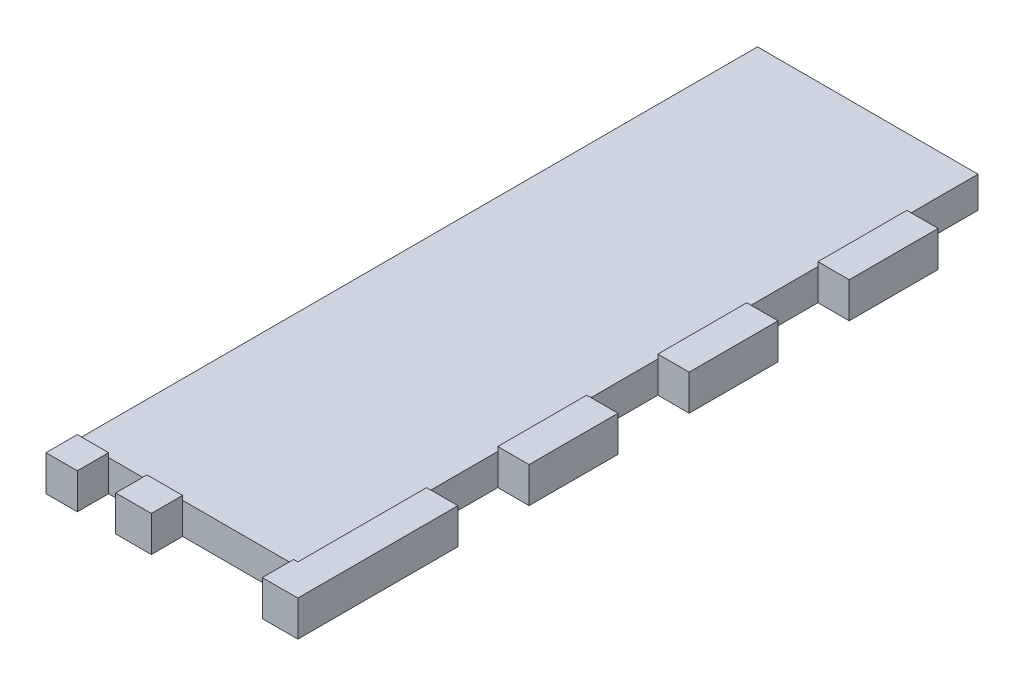
ISO-10303-21;
HEADER;
FILE_DESCRIPTION(('STEP AP214'),'2;1');
FILE_NAME('part.step','',(''),(''),'','','');
FILE_SCHEMA(('AUTOMOTIVE_DESIGN { 1 0 10303 214 1 1 1 1 }'));
ENDSEC;
DATA;
#1=APPLICATION_CONTEXT('core data for automotive mechanical design processes');
#2=APPLICATION_PROTOCOL_DEFINITION('international standard','automotive_design',2000,#1);
#3=PRODUCT_CONTEXT('',#1,'mechanical');
#4=PRODUCT('Part','Part','',(#3));
#5=PRODUCT_RELATED_PRODUCT_CATEGORY('part','',(#4));
#6=PRODUCT_DEFINITION_FORMATION('','',#4);
#7=PRODUCT_DEFINITION_CONTEXT('part definition',#1,'design');
#8=PRODUCT_DEFINITION('design','',#6,#7);
#9=PRODUCT_DEFINITION_SHAPE('','',#8);
#10=(LENGTH_UNIT() NAMED_UNIT(*) SI_UNIT(.MILLI.,.METRE.));
#11=(NAMED_UNIT(*) PLANE_ANGLE_UNIT() SI_UNIT($,.RADIAN.));
#12=(NAMED_UNIT(*) SI_UNIT($,.STERADIAN.) SOLID_ANGLE_UNIT());
#13=UNCERTAINTY_MEASURE_WITH_UNIT(LENGTH_MEASURE(1.E-05),#10,'distance_accuracy_value','');
#14=(GEOMETRIC_REPRESENTATION_CONTEXT(3) GLOBAL_UNCERTAINTY_ASSIGNED_CONTEXT((#13)) GLOBAL_UNIT_ASSIGNED_CONTEXT((#10,
#11,#12)) REPRESENTATION_CONTEXT('',''));
#15=CARTESIAN_POINT('',(0.,0.,0.));
#16=DIRECTION('',(0.,0.,1.));
#17=DIRECTION('',(1.,0.,0.));
#18=AXIS2_PLACEMENT_3D('',#15,#16,#17);
#19=CARTESIAN_POINT('',(0.,0.,0.));
#20=DIRECTION('',(0.,0.,1.));
#21=DIRECTION('',(1.,0.,0.));
#22=AXIS2_PLACEMENT_3D('',#19,#20,#21);
#23=PLANE('',#22);
#24=DIRECTION('',(1.,0.,0.));
#25=VECTOR('',#24,1.);
#26=CARTESIAN_POINT('',(-3.30200000000011,-143.002,0.));
#27=LINE('',#26,#25);
#28=CARTESIAN_POINT('',(-28.9560000000001,-143.002,0.));
#29=VERTEX_POINT('',#28);
#30=CARTESIAN_POINT('',(-23.3680000000001,-143.002,0.));
#31=VERTEX_POINT('',#30);
#32=EDGE_CURVE('E270',#29,#31,#27,.T.);
#33=ORIENTED_EDGE('',*,*,#32,.T.);
#34=DIRECTION('',(0.,-1.,0.));
#35=VECTOR('',#34,1.);
#36=CARTESIAN_POINT('',(-23.3680000000001,-143.002,0.));
#37=LINE('',#36,#35);
#38=CARTESIAN_POINT('',(-23.3680000000001,-143.764,0.));
#39=VERTEX_POINT('',#38);
#40=EDGE_CURVE('E253',#31,#39,#37,.T.);
#41=ORIENTED_EDGE('',*,*,#40,.T.);
#42=DIRECTION('',(1.,0.,0.));
#43=VECTOR('',#42,1.);
#44=CARTESIAN_POINT('',(-150.496526113721,-143.764,0.));
#45=LINE('',#44,#43);
#46=CARTESIAN_POINT('',(-28.9560000000001,-143.764,0.));
#47=VERTEX_POINT('',#46);
#48=EDGE_CURVE('E459',#47,#39,#45,.T.);
#49=ORIENTED_EDGE('',*,*,#48,.F.);
#50=DIRECTION('',(0.,-1.,0.));
#51=VECTOR('',#50,1.);
#52=CARTESIAN_POINT('',(-28.9560000000001,155.448,0.));
#53=LINE('',#52,#51);
#54=EDGE_CURVE('E277',#29,#47,#53,.T.);
#55=ORIENTED_EDGE('',*,*,#54,.F.);
#56=EDGE_LOOP('',(#33,#41,#49,#55));
#57=FACE_BOUND('',#56,.T.);
#58=ADVANCED_FACE('F36',(#57),#23,.F.);
#59=CARTESIAN_POINT('',(-16.5100000000001,-143.764,0.));
#60=VERTEX_POINT('',#59);
#61=CARTESIAN_POINT('',(-10.1600000000001,-143.764,0.));
#62=VERTEX_POINT('',#61);
#63=EDGE_CURVE('E617',#60,#62,#45,.T.);
#64=ORIENTED_EDGE('',*,*,#63,.F.);
#65=DIRECTION('',(0.,-1.,0.));
#66=VECTOR('',#65,1.);
#67=CARTESIAN_POINT('',(-16.5100000000001,-143.002,0.));
#68=LINE('',#67,#66);
#69=CARTESIAN_POINT('',(-16.5100000000001,-143.002,0.));
#70=VERTEX_POINT('',#69);
#71=EDGE_CURVE('E59',#70,#60,#68,.T.);
#72=ORIENTED_EDGE('',*,*,#71,.F.);
#73=CARTESIAN_POINT('',(-10.1600000000001,-143.002,0.));
#74=VERTEX_POINT('',#73);
#75=EDGE_CURVE('E279',#70,#74,#27,.T.);
#76=ORIENTED_EDGE('',*,*,#75,.T.);
#77=DIRECTION('',(0.,-1.,0.));
#78=VECTOR('',#77,1.);
#79=CARTESIAN_POINT('',(-10.1600000000001,-143.002,0.));
#80=LINE('',#79,#78);
#81=EDGE_CURVE('E336',#74,#62,#80,.T.);
#82=ORIENTED_EDGE('',*,*,#81,.T.);
#83=EDGE_LOOP('',(#64,#72,#76,#82));
#84=FACE_BOUND('',#83,.T.);
#85=ADVANCED_FACE('F592',(#84),#23,.F.);
#86=CARTESIAN_POINT('',(0.,0.,5.588));
#87=DIRECTION('',(0.,0.,1.));
#88=DIRECTION('',(1.,0.,0.));
#89=AXIS2_PLACEMENT_3D('',#86,#87,#88);
#90=PLANE('',#89);
#91=DIRECTION('',(0.,-1.,0.));
#92=VECTOR('',#91,1.);
#93=CARTESIAN_POINT('',(-23.3680000000001,-143.002,5.588));
#94=LINE('',#93,#92);
#95=CARTESIAN_POINT('',(-23.3680000000001,-143.002,5.588));
#96=VERTEX_POINT('',#95);
#97=CARTESIAN_POINT('',(-23.3680000000001,-149.352,5.588));
#98=VERTEX_POINT('',#97);
#99=EDGE_CURVE('E428',#96,#98,#94,.T.);
#100=ORIENTED_EDGE('',*,*,#99,.F.);
#101=DIRECTION('',(1.,0.,0.));
#102=VECTOR('',#101,1.);
#103=CARTESIAN_POINT('',(-3.30200000000011,-143.002,5.588));
#104=LINE('',#103,#102);
#105=CARTESIAN_POINT('',(-28.9560000000001,-143.002,5.58799999999996));
#106=VERTEX_POINT('',#105);
#107=EDGE_CURVE('E272',#106,#96,#104,.T.);
#108=ORIENTED_EDGE('',*,*,#107,.F.);
#109=DIRECTION('',(0.,-1.,0.));
#110=VECTOR('',#109,1.);
#111=CARTESIAN_POINT('',(-28.9560000000001,155.448,5.588));
#112=LINE('',#111,#110);
#113=CARTESIAN_POINT('',(-28.9560000000001,-149.352,5.588));
#114=VERTEX_POINT('',#113);
#115=EDGE_CURVE('E301',#106,#114,#112,.T.);
#116=ORIENTED_EDGE('',*,*,#115,.T.);
#117=DIRECTION('',(1.,0.,0.));
#118=VECTOR('',#117,1.);
#119=CARTESIAN_POINT('',(-28.9560000000001,-149.352,5.588));
#120=LINE('',#119,#118);
#121=EDGE_CURVE('E482',#114,#98,#120,.T.);
#122=ORIENTED_EDGE('',*,*,#121,.T.);
#123=EDGE_LOOP('',(#100,#108,#116,#122));
#124=FACE_BOUND('',#123,.T.);
#125=ADVANCED_FACE('F598',(#124),#90,.T.);
#126=DIRECTION('',(0.,-1.,0.));
#127=VECTOR('',#126,1.);
#128=CARTESIAN_POINT('',(-16.5100000000001,-143.002,5.588));
#129=LINE('',#128,#127);
#130=CARTESIAN_POINT('',(-16.5100000000001,-143.002,5.588));
#131=VERTEX_POINT('',#130);
#132=CARTESIAN_POINT('',(-16.5100000000001,-149.352,5.588));
#133=VERTEX_POINT('',#132);
#134=EDGE_CURVE('E316',#131,#133,#129,.T.);
#135=ORIENTED_EDGE('',*,*,#134,.T.);
#136=CARTESIAN_POINT('',(-10.1600000000001,-149.352,5.588));
#137=VERTEX_POINT('',#136);
#138=EDGE_CURVE('E319',#133,#137,#120,.T.);
#139=ORIENTED_EDGE('',*,*,#138,.T.);
#140=DIRECTION('',(0.,-1.,0.));
#141=VECTOR('',#140,1.);
#142=CARTESIAN_POINT('',(-10.1600000000001,-143.002,5.588));
#143=LINE('',#142,#141);
#144=CARTESIAN_POINT('',(-10.1600000000001,-143.002,5.588));
#145=VERTEX_POINT('',#144);
#146=EDGE_CURVE('E318',#145,#137,#143,.T.);
#147=ORIENTED_EDGE('',*,*,#146,.F.);
#148=EDGE_CURVE('E282',#131,#145,#104,.T.);
#149=ORIENTED_EDGE('',*,*,#148,.F.);
#150=EDGE_LOOP('',(#135,#139,#147,#149));
#151=FACE_BOUND('',#150,.T.);
#152=ADVANCED_FACE('F314',(#151),#90,.T.);
#153=CARTESIAN_POINT('',(-3.30200000000011,-143.002,5.588));
#154=DIRECTION('',(0.,1.,0.));
#155=DIRECTION('',(0.,0.,1.));
#156=AXIS2_PLACEMENT_3D('',#153,#154,#155);
#157=PLANE('',#156);
#158=DIRECTION('',(0.,0.,-1.));
#159=VECTOR('',#158,1.);
#160=CARTESIAN_POINT('',(-23.3680000000001,-143.002,5.588));
#161=LINE('',#160,#159);
#162=EDGE_CURVE('E257',#96,#31,#161,.T.);
#163=ORIENTED_EDGE('',*,*,#162,.T.);
#164=ORIENTED_EDGE('',*,*,#32,.F.);
#165=DIRECTION('',(0.,0.,-1.));
#166=VECTOR('',#165,1.);
#167=CARTESIAN_POINT('',(-28.9560000000001,-143.002,5.58799999999996));
#168=LINE('',#167,#166);
#169=EDGE_CURVE('E437',#106,#29,#168,.T.);
#170=ORIENTED_EDGE('',*,*,#169,.F.);
#171=ORIENTED_EDGE('',*,*,#107,.T.);
#172=EDGE_LOOP('',(#163,#164,#170,#171));
#173=FACE_BOUND('',#172,.T.);
#174=ADVANCED_FACE('F268',(#173),#157,.T.);
#175=DIRECTION('',(0.,0.,1.));
#176=VECTOR('',#175,1.);
#177=CARTESIAN_POINT('',(-16.5100000000001,-143.002,5.588));
#178=LINE('',#177,#176);
#179=EDGE_CURVE('E273',#70,#131,#178,.T.);
#180=ORIENTED_EDGE('',*,*,#179,.T.);
#181=ORIENTED_EDGE('',*,*,#148,.T.);
#182=DIRECTION('',(0.,0.,-1.));
#183=VECTOR('',#182,1.);
#184=CARTESIAN_POINT('',(-10.1600000000001,-143.002,5.588));
#185=LINE('',#184,#183);
#186=EDGE_CURVE('E310',#145,#74,#185,.T.);
#187=ORIENTED_EDGE('',*,*,#186,.T.);
#188=ORIENTED_EDGE('',*,*,#75,.F.);
#189=EDGE_LOOP('',(#180,#181,#187,#188));
#190=FACE_BOUND('',#189,.T.);
#191=ADVANCED_FACE('F308',(#190),#157,.T.);
#192=CARTESIAN_POINT('',(10.4139999999999,0.,0.));
#193=DIRECTION('',(1.,0.,0.));
#194=DIRECTION('',(0.,1.,0.));
#195=AXIS2_PLACEMENT_3D('',#192,#193,#194);
#196=PLANE('',#195);
#197=DIRECTION('',(0.,-1.,0.));
#198=VECTOR('',#197,1.);
#199=CARTESIAN_POINT('',(10.4139999999999,-143.002,-35.687));
#200=LINE('',#199,#198);
#201=CARTESIAN_POINT('',(10.4139999999999,-143.002,-35.687));
#202=VERTEX_POINT('',#201);
#203=CARTESIAN_POINT('',(10.4139999999999,-143.764,-35.687));
#204=VERTEX_POINT('',#203);
#205=EDGE_CURVE('E356',#202,#204,#200,.T.);
#206=ORIENTED_EDGE('',*,*,#205,.F.);
#207=DIRECTION('',(0.,0.,-1.));
#208=VECTOR('',#207,1.);
#209=CARTESIAN_POINT('',(10.4139999999999,-143.002,0.));
#210=LINE('',#209,#208);
#211=CARTESIAN_POINT('',(10.4139999999999,-143.002,-51.562));
#212=VERTEX_POINT('',#211);
#213=EDGE_CURVE('E447',#202,#212,#210,.T.);
#214=ORIENTED_EDGE('',*,*,#213,.T.);
#215=DIRECTION('',(0.,-1.,0.));
#216=VECTOR('',#215,1.);
#217=CARTESIAN_POINT('',(10.4139999999999,-143.002,-51.562));
#218=LINE('',#217,#216);
#219=CARTESIAN_POINT('',(10.4139999999999,-143.764,-51.562));
#220=VERTEX_POINT('',#219);
#221=EDGE_CURVE('E386',#212,#220,#218,.T.);
#222=ORIENTED_EDGE('',*,*,#221,.T.);
#223=DIRECTION('',(0.,0.,-1.));
#224=VECTOR('',#223,1.);
#225=CARTESIAN_POINT('',(10.4139999999999,-143.764,-121.412));
#226=LINE('',#225,#224);
#227=EDGE_CURVE('E568',#204,#220,#226,.T.);
#228=ORIENTED_EDGE('',*,*,#227,.F.);
#229=EDGE_LOOP('',(#206,#214,#222,#228));
#230=FACE_BOUND('',#229,.T.);
#231=ADVANCED_FACE('F567',(#230),#196,.F.);
#232=DIRECTION('',(0.,-1.,0.));
#233=VECTOR('',#232,1.);
#234=CARTESIAN_POINT('',(10.4139999999999,-143.002,-64.262));
#235=LINE('',#234,#233);
#236=CARTESIAN_POINT('',(10.4139999999999,-143.002,-64.262));
#237=VERTEX_POINT('',#236);
#238=CARTESIAN_POINT('',(10.4139999999999,-143.764,-64.262));
#239=VERTEX_POINT('',#238);
#240=EDGE_CURVE('E351',#237,#239,#235,.T.);
#241=ORIENTED_EDGE('',*,*,#240,.F.);
#242=CARTESIAN_POINT('',(10.4139999999999,-143.002,-80.137));
#243=VERTEX_POINT('',#242);
#244=EDGE_CURVE('E520',#237,#243,#210,.T.);
#245=ORIENTED_EDGE('',*,*,#244,.T.);
#246=DIRECTION('',(0.,-1.,0.));
#247=VECTOR('',#246,1.);
#248=CARTESIAN_POINT('',(10.4139999999999,-143.002,-80.137));
#249=LINE('',#248,#247);
#250=CARTESIAN_POINT('',(10.4139999999999,-143.764,-80.137));
#251=VERTEX_POINT('',#250);
#252=EDGE_CURVE('E412',#243,#251,#249,.T.);
#253=ORIENTED_EDGE('',*,*,#252,.T.);
#254=EDGE_CURVE('E570',#239,#251,#226,.T.);
#255=ORIENTED_EDGE('',*,*,#254,.F.);
#256=EDGE_LOOP('',(#241,#245,#253,#255));
#257=FACE_BOUND('',#256,.T.);
#258=ADVANCED_FACE('F524',(#257),#196,.F.);
#259=DIRECTION('',(0.,-1.,0.));
#260=VECTOR('',#259,1.);
#261=CARTESIAN_POINT('',(10.4139999999999,-143.002,-92.837));
#262=LINE('',#261,#260);
#263=CARTESIAN_POINT('',(10.4139999999999,-143.002,-92.837));
#264=VERTEX_POINT('',#263);
#265=CARTESIAN_POINT('',(10.4139999999999,-143.764,-92.837));
#266=VERTEX_POINT('',#265);
#267=EDGE_CURVE('E379',#264,#266,#262,.T.);
#268=ORIENTED_EDGE('',*,*,#267,.F.);
#269=CARTESIAN_POINT('',(10.4139999999999,-143.002,-108.712));
#270=VERTEX_POINT('',#269);
#271=EDGE_CURVE('E439',#264,#270,#210,.T.);
#272=ORIENTED_EDGE('',*,*,#271,.T.);
#273=DIRECTION('',(0.,-1.,0.));
#274=VECTOR('',#273,1.);
#275=CARTESIAN_POINT('',(10.4139999999999,-143.002,-108.712));
#276=LINE('',#275,#274);
#277=CARTESIAN_POINT('',(10.4139999999999,-143.764,-108.712));
#278=VERTEX_POINT('',#277);
#279=EDGE_CURVE('E432',#270,#278,#276,.T.);
#280=ORIENTED_EDGE('',*,*,#279,.T.);
#281=EDGE_CURVE('E573',#266,#278,#226,.T.);
#282=ORIENTED_EDGE('',*,*,#281,.F.);
#283=EDGE_LOOP('',(#268,#272,#280,#282));
#284=FACE_BOUND('',#283,.T.);
#285=ADVANCED_FACE('F532',(#284),#196,.F.);
#286=CARTESIAN_POINT('',(-28.9560000000001,-149.352,5.588));
#287=DIRECTION('',(0.,1.,0.));
#288=DIRECTION('',(0.,0.,1.));
#289=AXIS2_PLACEMENT_3D('',#286,#287,#288);
#290=PLANE('',#289);
#291=DIRECTION('',(1.,0.,0.));
#292=VECTOR('',#291,1.);
#293=CARTESIAN_POINT('',(-23.3680000000001,-149.352,0.));
#294=LINE('',#293,#292);
#295=CARTESIAN_POINT('',(-23.3680000000001,-149.352,0.));
#296=VERTEX_POINT('',#295);
#297=CARTESIAN_POINT('',(-16.5100000000001,-149.352,0.));
#298=VERTEX_POINT('',#297);
#299=EDGE_CURVE('E326',#296,#298,#294,.T.);
#300=ORIENTED_EDGE('',*,*,#299,.F.);
#301=DIRECTION('',(0.,0.,-1.));
#302=VECTOR('',#301,1.);
#303=CARTESIAN_POINT('',(-23.3680000000001,-149.352,5.588));
#304=LINE('',#303,#302);
#305=EDGE_CURVE('E323',#98,#296,#304,.T.);
#306=ORIENTED_EDGE('',*,*,#305,.F.);
#307=ORIENTED_EDGE('',*,*,#121,.F.);
#308=DIRECTION('',(0.,0.,-1.));
#309=VECTOR('',#308,1.);
#310=CARTESIAN_POINT('',(-28.9560000000001,-149.352,5.588));
#311=LINE('',#310,#309);
#312=CARTESIAN_POINT('',(-28.9560000000001,-149.352,-121.412));
#313=VERTEX_POINT('',#312);
#314=EDGE_CURVE('E12',#114,#313,#311,.T.);
#315=ORIENTED_EDGE('',*,*,#314,.T.);
#316=DIRECTION('',(1.,0.,0.));
#317=VECTOR('',#316,1.);
#318=CARTESIAN_POINT('',(10.4139999999999,-149.352,-121.412));
#319=LINE('',#318,#317);
#320=CARTESIAN_POINT('',(10.4139999999999,-149.352,-121.412));
#321=VERTEX_POINT('',#320);
#322=EDGE_CURVE('E292',#313,#321,#319,.T.);
#323=ORIENTED_EDGE('',*,*,#322,.T.);
#324=DIRECTION('',(0.,0.,-1.));
#325=VECTOR('',#324,1.);
#326=CARTESIAN_POINT('',(10.4139999999999,-149.352,0.));
#327=LINE('',#326,#325);
#328=CARTESIAN_POINT('',(10.4139999999999,-149.352,-108.712));
#329=VERTEX_POINT('',#328);
#330=EDGE_CURVE('E424',#329,#321,#327,.T.);
#331=ORIENTED_EDGE('',*,*,#330,.F.);
#332=DIRECTION('',(-1.,0.,0.));
#333=VECTOR('',#332,1.);
#334=CARTESIAN_POINT('',(0.,-149.352,-108.712));
#335=LINE('',#334,#333);
#336=CARTESIAN_POINT('',(16.0019999999999,-149.352,-108.712));
#337=VERTEX_POINT('',#336);
#338=EDGE_CURVE('E425',#337,#329,#335,.T.);
#339=ORIENTED_EDGE('',*,*,#338,.F.);
#340=DIRECTION('',(0.,0.,-1.));
#341=VECTOR('',#340,1.);
#342=CARTESIAN_POINT('',(16.0019999999999,-149.352,5.588));
#343=LINE('',#342,#341);
#344=CARTESIAN_POINT('',(16.0019999999999,-149.352,-92.837));
#345=VERTEX_POINT('',#344);
#346=EDGE_CURVE('E489',#345,#337,#343,.T.);
#347=ORIENTED_EDGE('',*,*,#346,.F.);
#348=DIRECTION('',(-1.,0.,0.));
#349=VECTOR('',#348,1.);
#350=CARTESIAN_POINT('',(-2.30560520170738E-13,-149.352,-92.837));
#351=LINE('',#350,#349);
#352=CARTESIAN_POINT('',(10.4139999999999,-149.352,-92.837));
#353=VERTEX_POINT('',#352);
#354=EDGE_CURVE('E401',#345,#353,#351,.T.);
#355=ORIENTED_EDGE('',*,*,#354,.T.);
#356=DIRECTION('',(0.,0.,-1.));
#357=VECTOR('',#356,1.);
#358=CARTESIAN_POINT('',(10.4139999999999,-149.352,0.));
#359=LINE('',#358,#357);
#360=CARTESIAN_POINT('',(10.4139999999999,-149.352,-80.137));
#361=VERTEX_POINT('',#360);
#362=EDGE_CURVE('E397',#361,#353,#359,.T.);
#363=ORIENTED_EDGE('',*,*,#362,.F.);
#364=DIRECTION('',(-1.,0.,0.));
#365=VECTOR('',#364,1.);
#366=CARTESIAN_POINT('',(0.,-149.352,-80.137));
#367=LINE('',#366,#365);
#368=CARTESIAN_POINT('',(16.0019999999999,-149.352,-80.137));
#369=VERTEX_POINT('',#368);
#370=EDGE_CURVE('E404',#369,#361,#367,.T.);
#371=ORIENTED_EDGE('',*,*,#370,.F.);
#372=CARTESIAN_POINT('',(16.0019999999999,-149.352,-64.262));
#373=VERTEX_POINT('',#372);
#374=EDGE_CURVE('E497',#373,#369,#343,.T.);
#375=ORIENTED_EDGE('',*,*,#374,.F.);
#376=DIRECTION('',(-1.,0.,0.));
#377=VECTOR('',#376,1.);
#378=CARTESIAN_POINT('',(-1.59594559789868E-13,-149.352,-64.262));
#379=LINE('',#378,#377);
#380=CARTESIAN_POINT('',(10.4139999999999,-149.352,-64.262));
#381=VERTEX_POINT('',#380);
#382=EDGE_CURVE('E375',#373,#381,#379,.T.);
#383=ORIENTED_EDGE('',*,*,#382,.T.);
#384=DIRECTION('',(0.,0.,-1.));
#385=VECTOR('',#384,1.);
#386=CARTESIAN_POINT('',(10.4139999999999,-149.352,0.));
#387=LINE('',#386,#385);
#388=CARTESIAN_POINT('',(10.4139999999999,-149.352,-51.562));
#389=VERTEX_POINT('',#388);
#390=EDGE_CURVE('E371',#389,#381,#387,.T.);
#391=ORIENTED_EDGE('',*,*,#390,.F.);
#392=DIRECTION('',(-1.,0.,0.));
#393=VECTOR('',#392,1.);
#394=CARTESIAN_POINT('',(0.,-149.352,-51.562));
#395=LINE('',#394,#393);
#396=CARTESIAN_POINT('',(16.0019999999999,-149.352,-51.562));
#397=VERTEX_POINT('',#396);
#398=EDGE_CURVE('E378',#397,#389,#395,.T.);
#399=ORIENTED_EDGE('',*,*,#398,.F.);
#400=CARTESIAN_POINT('',(16.0019999999999,-149.352,-35.687));
#401=VERTEX_POINT('',#400);
#402=EDGE_CURVE('E491',#401,#397,#343,.T.);
#403=ORIENTED_EDGE('',*,*,#402,.F.);
#404=DIRECTION('',(-1.,0.,0.));
#405=VECTOR('',#404,1.);
#406=CARTESIAN_POINT('',(0.,-149.352,-35.687));
#407=LINE('',#406,#405);
#408=CARTESIAN_POINT('',(10.4139999999999,-149.352,-35.687));
#409=VERTEX_POINT('',#408);
#410=EDGE_CURVE('E347',#401,#409,#407,.T.);
#411=ORIENTED_EDGE('',*,*,#410,.T.);
#412=DIRECTION('',(0.,0.,-1.));
#413=VECTOR('',#412,1.);
#414=CARTESIAN_POINT('',(10.4139999999999,-149.352,0.));
#415=LINE('',#414,#413);
#416=CARTESIAN_POINT('',(10.4139999999999,-149.352,-22.987));
#417=VERTEX_POINT('',#416);
#418=EDGE_CURVE('E343',#417,#409,#415,.T.);
#419=ORIENTED_EDGE('',*,*,#418,.F.);
#420=DIRECTION('',(-1.,0.,0.));
#421=VECTOR('',#420,1.);
#422=CARTESIAN_POINT('',(0.,-149.352,-22.987));
#423=LINE('',#422,#421);
#424=CARTESIAN_POINT('',(16.0019999999999,-149.352,-22.987));
#425=VERTEX_POINT('',#424);
#426=EDGE_CURVE('E350',#425,#417,#423,.T.);
#427=ORIENTED_EDGE('',*,*,#426,.F.);
#428=CARTESIAN_POINT('',(16.0019999999999,-149.352,5.588));
#429=VERTEX_POINT('',#428);
#430=EDGE_CURVE('E44',#429,#425,#343,.T.);
#431=ORIENTED_EDGE('',*,*,#430,.F.);
#432=CARTESIAN_POINT('',(9.65199999999993,-149.352,5.588));
#433=VERTEX_POINT('',#432);
#434=EDGE_CURVE('E484',#433,#429,#120,.T.);
#435=ORIENTED_EDGE('',*,*,#434,.F.);
#436=DIRECTION('',(0.,0.,1.));
#437=VECTOR('',#436,1.);
#438=CARTESIAN_POINT('',(9.65199999999993,-149.352,5.588));
#439=LINE('',#438,#437);
#440=CARTESIAN_POINT('',(9.65199999999993,-149.352,0.));
#441=VERTEX_POINT('',#440);
#442=EDGE_CURVE('E331',#441,#433,#439,.T.);
#443=ORIENTED_EDGE('',*,*,#442,.F.);
#444=DIRECTION('',(1.,0.,0.));
#445=VECTOR('',#444,1.);
#446=CARTESIAN_POINT('',(-10.1600000000001,-149.352,0.));
#447=LINE('',#446,#445);
#448=CARTESIAN_POINT('',(-10.1600000000001,-149.352,0.));
#449=VERTEX_POINT('',#448);
#450=EDGE_CURVE('E636',#449,#441,#447,.T.);
#451=ORIENTED_EDGE('',*,*,#450,.F.);
#452=DIRECTION('',(0.,0.,-1.));
#453=VECTOR('',#452,1.);
#454=CARTESIAN_POINT('',(-10.1600000000001,-149.352,5.588));
#455=LINE('',#454,#453);
#456=EDGE_CURVE('E626',#137,#449,#455,.T.);
#457=ORIENTED_EDGE('',*,*,#456,.F.);
#458=ORIENTED_EDGE('',*,*,#138,.F.);
#459=DIRECTION('',(0.,0.,1.));
#460=VECTOR('',#459,1.);
#461=CARTESIAN_POINT('',(-16.5100000000001,-149.352,5.588));
#462=LINE('',#461,#460);
#463=EDGE_CURVE('E274',#298,#133,#462,.T.);
#464=ORIENTED_EDGE('',*,*,#463,.F.);
#465=EDGE_LOOP('',(#300,#306,#307,#315,#323,#331,#339,#347,#355,#363,#371,#375,#383,#391,#399,
#403,#411,#419,#427,#431,#435,#443,#451,#457,#458,#464));
#466=FACE_BOUND('',#465,.T.);
#467=ADVANCED_FACE('F477',(#466),#290,.F.);
#468=CARTESIAN_POINT('',(16.0019999999999,155.448,5.588));
#469=DIRECTION('',(-1.,0.,0.));
#470=DIRECTION('',(0.,-1.,0.));
#471=AXIS2_PLACEMENT_3D('',#468,#469,#470);
#472=PLANE('',#471);
#473=DIRECTION('',(0.,-1.,0.));
#474=VECTOR('',#473,1.);
#475=CARTESIAN_POINT('',(16.0019999999999,-143.002,-35.687));
#476=LINE('',#475,#474);
#477=CARTESIAN_POINT('',(16.0019999999999,-143.002,-35.687));
#478=VERTEX_POINT('',#477);
#479=EDGE_CURVE('E346',#478,#401,#476,.T.);
#480=ORIENTED_EDGE('',*,*,#479,.T.);
#481=ORIENTED_EDGE('',*,*,#402,.T.);
#482=DIRECTION('',(0.,-1.,0.));
#483=VECTOR('',#482,1.);
#484=CARTESIAN_POINT('',(16.0019999999999,-143.002,-51.562));
#485=LINE('',#484,#483);
#486=CARTESIAN_POINT('',(16.0019999999999,-143.002,-51.562));
#487=VERTEX_POINT('',#486);
#488=EDGE_CURVE('E390',#487,#397,#485,.T.);
#489=ORIENTED_EDGE('',*,*,#488,.F.);
#490=DIRECTION('',(0.,0.,-1.));
#491=VECTOR('',#490,1.);
#492=CARTESIAN_POINT('',(16.0019999999999,-143.002,5.58799999999996));
#493=LINE('',#492,#491);
#494=EDGE_CURVE('E443',#478,#487,#493,.T.);
#495=ORIENTED_EDGE('',*,*,#494,.F.);
#496=EDGE_LOOP('',(#480,#481,#489,#495));
#497=FACE_BOUND('',#496,.T.);
#498=ADVANCED_FACE('F552',(#497),#472,.F.);
#499=DIRECTION('',(0.,-1.,0.));
#500=VECTOR('',#499,1.);
#501=CARTESIAN_POINT('',(16.0019999999999,-143.002,-64.262));
#502=LINE('',#501,#500);
#503=CARTESIAN_POINT('',(16.0019999999999,-143.002,-64.262));
#504=VERTEX_POINT('',#503);
#505=EDGE_CURVE('E374',#504,#373,#502,.T.);
#506=ORIENTED_EDGE('',*,*,#505,.T.);
#507=ORIENTED_EDGE('',*,*,#374,.T.);
#508=DIRECTION('',(0.,-1.,0.));
#509=VECTOR('',#508,1.);
#510=CARTESIAN_POINT('',(16.0019999999999,-143.002,-80.137));
#511=LINE('',#510,#509);
#512=CARTESIAN_POINT('',(16.0019999999999,-143.002,-80.137));
#513=VERTEX_POINT('',#512);
#514=EDGE_CURVE('E416',#513,#369,#511,.T.);
#515=ORIENTED_EDGE('',*,*,#514,.F.);
#516=EDGE_CURVE('E521',#504,#513,#493,.T.);
#517=ORIENTED_EDGE('',*,*,#516,.F.);
#518=EDGE_LOOP('',(#506,#507,#515,#517));
#519=FACE_BOUND('',#518,.T.);
#520=ADVANCED_FACE('F506',(#519),#472,.F.);
#521=DIRECTION('',(0.,-1.,0.));
#522=VECTOR('',#521,1.);
#523=CARTESIAN_POINT('',(16.0019999999999,-143.002,-92.837));
#524=LINE('',#523,#522);
#525=CARTESIAN_POINT('',(16.0019999999999,-143.002,-92.837));
#526=VERTEX_POINT('',#525);
#527=EDGE_CURVE('E400',#526,#345,#524,.T.);
#528=ORIENTED_EDGE('',*,*,#527,.T.);
#529=ORIENTED_EDGE('',*,*,#346,.T.);
#530=DIRECTION('',(0.,-1.,0.));
#531=VECTOR('',#530,1.);
#532=CARTESIAN_POINT('',(16.0019999999999,-143.002,-108.712));
#533=LINE('',#532,#531);
#534=CARTESIAN_POINT('',(16.0019999999999,-143.002,-108.712));
#535=VERTEX_POINT('',#534);
#536=EDGE_CURVE('E423',#535,#337,#533,.T.);
#537=ORIENTED_EDGE('',*,*,#536,.F.);
#538=EDGE_CURVE('E358',#526,#535,#493,.T.);
#539=ORIENTED_EDGE('',*,*,#538,.F.);
#540=EDGE_LOOP('',(#528,#529,#537,#539));
#541=FACE_BOUND('',#540,.T.);
#542=ADVANCED_FACE('F543',(#541),#472,.F.);
#543=ORIENTED_EDGE('',*,*,#213,.F.);
#544=DIRECTION('',(-1.,0.,0.));
#545=VECTOR('',#544,1.);
#546=CARTESIAN_POINT('',(0.,-143.002,-35.687));
#547=LINE('',#546,#545);
#548=EDGE_CURVE('E340',#478,#202,#547,.T.);
#549=ORIENTED_EDGE('',*,*,#548,.F.);
#550=ORIENTED_EDGE('',*,*,#494,.T.);
#551=DIRECTION('',(-1.,0.,0.));
#552=VECTOR('',#551,1.);
#553=CARTESIAN_POINT('',(0.,-143.002,-51.562));
#554=LINE('',#553,#552);
#555=EDGE_CURVE('E370',#487,#212,#554,.T.);
#556=ORIENTED_EDGE('',*,*,#555,.T.);
#557=EDGE_LOOP('',(#543,#549,#550,#556));
#558=FACE_BOUND('',#557,.T.);
#559=ADVANCED_FACE('F549',(#558),#157,.T.);
#560=ORIENTED_EDGE('',*,*,#244,.F.);
#561=DIRECTION('',(-1.,0.,0.));
#562=VECTOR('',#561,1.);
#563=CARTESIAN_POINT('',(-1.59594559789868E-13,-143.002,-64.262));
#564=LINE('',#563,#562);
#565=EDGE_CURVE('E368',#504,#237,#564,.T.);
#566=ORIENTED_EDGE('',*,*,#565,.F.);
#567=ORIENTED_EDGE('',*,*,#516,.T.);
#568=DIRECTION('',(-1.,0.,0.));
#569=VECTOR('',#568,1.);
#570=CARTESIAN_POINT('',(0.,-143.002,-80.137));
#571=LINE('',#570,#569);
#572=EDGE_CURVE('E396',#513,#243,#571,.T.);
#573=ORIENTED_EDGE('',*,*,#572,.T.);
#574=EDGE_LOOP('',(#560,#566,#567,#573));
#575=FACE_BOUND('',#574,.T.);
#576=ADVANCED_FACE('F518',(#575),#157,.T.);
#577=ORIENTED_EDGE('',*,*,#271,.F.);
#578=DIRECTION('',(-1.,0.,0.));
#579=VECTOR('',#578,1.);
#580=CARTESIAN_POINT('',(-2.30560520170738E-13,-143.002,-92.837));
#581=LINE('',#580,#579);
#582=EDGE_CURVE('E394',#526,#264,#581,.T.);
#583=ORIENTED_EDGE('',*,*,#582,.F.);
#584=ORIENTED_EDGE('',*,*,#538,.T.);
#585=DIRECTION('',(-1.,0.,0.));
#586=VECTOR('',#585,1.);
#587=CARTESIAN_POINT('',(0.,-143.002,-108.712));
#588=LINE('',#587,#586);
#589=EDGE_CURVE('E420',#535,#270,#588,.T.);
#590=ORIENTED_EDGE('',*,*,#589,.T.);
#591=EDGE_LOOP('',(#577,#583,#584,#590));
#592=FACE_BOUND('',#591,.T.);
#593=ADVANCED_FACE('F537',(#592),#157,.T.);
#594=CARTESIAN_POINT('',(9.65199999999994,-143.764,0.));
#595=VERTEX_POINT('',#594);
#596=CARTESIAN_POINT('',(10.4139999999999,-143.764,0.));
#597=VERTEX_POINT('',#596);
#598=EDGE_CURVE('E458',#595,#597,#45,.T.);
#599=ORIENTED_EDGE('',*,*,#598,.F.);
#600=DIRECTION('',(0.,-1.,0.));
#601=VECTOR('',#600,1.);
#602=CARTESIAN_POINT('',(9.65199999999993,-143.002,0.));
#603=LINE('',#602,#601);
#604=CARTESIAN_POINT('',(9.65199999999993,-143.002,0.));
#605=VERTEX_POINT('',#604);
#606=EDGE_CURVE('E51',#605,#595,#603,.T.);
#607=ORIENTED_EDGE('',*,*,#606,.F.);
#608=CARTESIAN_POINT('',(10.4139999999999,-143.002,0.));
#609=VERTEX_POINT('',#608);
#610=EDGE_CURVE('E281',#605,#609,#27,.T.);
#611=ORIENTED_EDGE('',*,*,#610,.T.);
#612=DIRECTION('',(0.,1.,0.));
#613=VECTOR('',#612,1.);
#614=CARTESIAN_POINT('',(10.4139999999999,0.,0.));
#615=LINE('',#614,#613);
#616=EDGE_CURVE('E286',#597,#609,#615,.T.);
#617=ORIENTED_EDGE('',*,*,#616,.F.);
#618=EDGE_LOOP('',(#599,#607,#611,#617));
#619=FACE_BOUND('',#618,.T.);
#620=ADVANCED_FACE('F594',(#619),#23,.F.);
#621=CARTESIAN_POINT('',(10.4139999999999,-143.002,-22.987));
#622=VERTEX_POINT('',#621);
#623=EDGE_CURVE('E444',#609,#622,#210,.T.);
#624=ORIENTED_EDGE('',*,*,#623,.T.);
#625=DIRECTION('',(0.,-1.,0.));
#626=VECTOR('',#625,1.);
#627=CARTESIAN_POINT('',(10.4139999999999,-143.002,-22.987));
#628=LINE('',#627,#626);
#629=CARTESIAN_POINT('',(10.4139999999999,-143.764,-22.987));
#630=VERTEX_POINT('',#629);
#631=EDGE_CURVE('E360',#622,#630,#628,.T.);
#632=ORIENTED_EDGE('',*,*,#631,.T.);
#633=EDGE_CURVE('E451',#597,#630,#226,.T.);
#634=ORIENTED_EDGE('',*,*,#633,.F.);
#635=ORIENTED_EDGE('',*,*,#616,.T.);
#636=EDGE_LOOP('',(#624,#632,#634,#635));
#637=FACE_BOUND('',#636,.T.);
#638=ADVANCED_FACE('F603',(#637),#196,.F.);
#639=DIRECTION('',(0.,-1.,0.));
#640=VECTOR('',#639,1.);
#641=CARTESIAN_POINT('',(9.65199999999993,-143.002,5.588));
#642=LINE('',#641,#640);
#643=CARTESIAN_POINT('',(9.65199999999993,-143.002,5.588));
#644=VERTEX_POINT('',#643);
#645=EDGE_CURVE('E324',#644,#433,#642,.T.);
#646=ORIENTED_EDGE('',*,*,#645,.T.);
#647=ORIENTED_EDGE('',*,*,#434,.T.);
#648=DIRECTION('',(0.,1.,0.));
#649=VECTOR('',#648,1.);
#650=CARTESIAN_POINT('',(16.0019999999999,155.448,5.588));
#651=LINE('',#650,#649);
#652=CARTESIAN_POINT('',(16.0019999999999,-143.002,5.58799999999996));
#653=VERTEX_POINT('',#652);
#654=EDGE_CURVE('E487',#429,#653,#651,.T.);
#655=ORIENTED_EDGE('',*,*,#654,.T.);
#656=EDGE_CURVE('E278',#644,#653,#104,.T.);
#657=ORIENTED_EDGE('',*,*,#656,.F.);
#658=EDGE_LOOP('',(#646,#647,#655,#657));
#659=FACE_BOUND('',#658,.T.);
#660=ADVANCED_FACE('F608',(#659),#90,.T.);
#661=CARTESIAN_POINT('',(-28.9560000000001,155.448,5.588));
#662=DIRECTION('',(1.,0.,0.));
#663=DIRECTION('',(0.,1.,0.));
#664=AXIS2_PLACEMENT_3D('',#661,#662,#663);
#665=PLANE('',#664);
#666=ORIENTED_EDGE('',*,*,#115,.F.);
#667=ORIENTED_EDGE('',*,*,#169,.T.);
#668=ORIENTED_EDGE('',*,*,#54,.T.);
#669=DIRECTION('',(0.,0.,1.));
#670=VECTOR('',#669,1.);
#671=CARTESIAN_POINT('',(-28.9560000000001,-143.764,-121.412));
#672=LINE('',#671,#670);
#673=CARTESIAN_POINT('',(-28.9560000000001,-143.764,-121.412));
#674=VERTEX_POINT('',#673);
#675=EDGE_CURVE('E450',#674,#47,#672,.T.);
#676=ORIENTED_EDGE('',*,*,#675,.F.);
#677=DIRECTION('',(0.,1.,0.));
#678=VECTOR('',#677,1.);
#679=CARTESIAN_POINT('',(-28.9560000000001,-143.764,-121.412));
#680=LINE('',#679,#678);
#681=EDGE_CURVE('E298',#313,#674,#680,.T.);
#682=ORIENTED_EDGE('',*,*,#681,.F.);
#683=ORIENTED_EDGE('',*,*,#314,.F.);
#684=EDGE_LOOP('',(#666,#667,#668,#676,#682,#683));
#685=FACE_BOUND('',#684,.T.);
#686=ADVANCED_FACE('F38',(#685),#665,.F.);
#687=ORIENTED_EDGE('',*,*,#430,.T.);
#688=DIRECTION('',(0.,-1.,0.));
#689=VECTOR('',#688,1.);
#690=CARTESIAN_POINT('',(16.0019999999999,-143.002,-22.987));
#691=LINE('',#690,#689);
#692=CARTESIAN_POINT('',(16.0019999999999,-143.002,-22.987));
#693=VERTEX_POINT('',#692);
#694=EDGE_CURVE('E364',#693,#425,#691,.T.);
#695=ORIENTED_EDGE('',*,*,#694,.F.);
#696=EDGE_CURVE('E440',#653,#693,#493,.T.);
#697=ORIENTED_EDGE('',*,*,#696,.F.);
#698=ORIENTED_EDGE('',*,*,#654,.F.);
#699=EDGE_LOOP('',(#687,#695,#697,#698));
#700=FACE_BOUND('',#699,.T.);
#701=ADVANCED_FACE('F644',(#700),#472,.F.);
#702=DIRECTION('',(0.,0.,1.));
#703=VECTOR('',#702,1.);
#704=CARTESIAN_POINT('',(9.65199999999993,-143.002,5.588));
#705=LINE('',#704,#703);
#706=EDGE_CURVE('E629',#605,#644,#705,.T.);
#707=ORIENTED_EDGE('',*,*,#706,.T.);
#708=ORIENTED_EDGE('',*,*,#656,.T.);
#709=ORIENTED_EDGE('',*,*,#696,.T.);
#710=DIRECTION('',(-1.,0.,0.));
#711=VECTOR('',#710,1.);
#712=CARTESIAN_POINT('',(0.,-143.002,-22.987));
#713=LINE('',#712,#711);
#714=EDGE_CURVE('E342',#693,#622,#713,.T.);
#715=ORIENTED_EDGE('',*,*,#714,.T.);
#716=ORIENTED_EDGE('',*,*,#623,.F.);
#717=ORIENTED_EDGE('',*,*,#610,.F.);
#718=EDGE_LOOP('',(#707,#708,#709,#715,#716,#717));
#719=FACE_BOUND('',#718,.T.);
#720=ADVANCED_FACE('F611',(#719),#157,.T.);
#721=CARTESIAN_POINT('',(10.4139999999999,-1.34016615816207E-13,-121.412));
#722=DIRECTION('',(0.,0.,1.));
#723=DIRECTION('',(0.,-1.,0.));
#724=AXIS2_PLACEMENT_3D('',#721,#722,#723);
#725=PLANE('',#724);
#726=DIRECTION('',(1.,0.,0.));
#727=VECTOR('',#726,1.);
#728=CARTESIAN_POINT('',(-150.496526113721,-143.764,-121.412));
#729=LINE('',#728,#727);
#730=CARTESIAN_POINT('',(10.4139999999999,-143.764,-121.412));
#731=VERTEX_POINT('',#730);
#732=EDGE_CURVE('E454',#674,#731,#729,.T.);
#733=ORIENTED_EDGE('',*,*,#732,.T.);
#734=DIRECTION('',(0.,-1.,0.));
#735=VECTOR('',#734,1.);
#736=CARTESIAN_POINT('',(10.4139999999999,-143.002,-121.412));
#737=LINE('',#736,#735);
#738=EDGE_CURVE('E405',#731,#321,#737,.T.);
#739=ORIENTED_EDGE('',*,*,#738,.T.);
#740=ORIENTED_EDGE('',*,*,#322,.F.);
#741=ORIENTED_EDGE('',*,*,#681,.T.);
#742=EDGE_LOOP('',(#733,#739,#740,#741));
#743=FACE_BOUND('',#742,.T.);
#744=ADVANCED_FACE('F473',(#743),#725,.F.);
#745=CARTESIAN_POINT('',(-150.496526113721,-143.764,-121.412));
#746=DIRECTION('',(0.,-1.,0.));
#747=DIRECTION('',(1.,0.,0.));
#748=AXIS2_PLACEMENT_3D('',#745,#746,#747);
#749=PLANE('',#748);
#750=ORIENTED_EDGE('',*,*,#732,.F.);
#751=ORIENTED_EDGE('',*,*,#675,.T.);
#752=ORIENTED_EDGE('',*,*,#48,.T.);
#753=EDGE_CURVE('E460',#39,#60,#45,.T.);
#754=ORIENTED_EDGE('',*,*,#753,.T.);
#755=ORIENTED_EDGE('',*,*,#63,.T.);
#756=EDGE_CURVE('E614',#62,#595,#45,.T.);
#757=ORIENTED_EDGE('',*,*,#756,.T.);
#758=ORIENTED_EDGE('',*,*,#598,.T.);
#759=ORIENTED_EDGE('',*,*,#633,.T.);
#760=EDGE_CURVE('E455',#630,#204,#226,.T.);
#761=ORIENTED_EDGE('',*,*,#760,.T.);
#762=ORIENTED_EDGE('',*,*,#227,.T.);
#763=EDGE_CURVE('E562',#220,#239,#226,.T.);
#764=ORIENTED_EDGE('',*,*,#763,.T.);
#765=ORIENTED_EDGE('',*,*,#254,.T.);
#766=EDGE_CURVE('E571',#251,#266,#226,.T.);
#767=ORIENTED_EDGE('',*,*,#766,.T.);
#768=ORIENTED_EDGE('',*,*,#281,.T.);
#769=EDGE_CURVE('E446',#278,#731,#226,.T.);
#770=ORIENTED_EDGE('',*,*,#769,.T.);
#771=EDGE_LOOP('',(#750,#751,#752,#754,#755,#757,#758,#759,#761,#762,#764,#765,#767,#768,#770));
#772=FACE_BOUND('',#771,.T.);
#773=ADVANCED_FACE('F464',(#772),#749,.F.);
#774=CARTESIAN_POINT('',(10.4139999999999,-143.002,0.));
#775=DIRECTION('',(-1.,0.,0.));
#776=DIRECTION('',(0.,0.,1.));
#777=AXIS2_PLACEMENT_3D('',#774,#775,#776);
#778=PLANE('',#777);
#779=EDGE_CURVE('E435',#278,#329,#276,.T.);
#780=ORIENTED_EDGE('',*,*,#779,.T.);
#781=ORIENTED_EDGE('',*,*,#330,.T.);
#782=ORIENTED_EDGE('',*,*,#738,.F.);
#783=ORIENTED_EDGE('',*,*,#769,.F.);
#784=EDGE_LOOP('',(#780,#781,#782,#783));
#785=FACE_BOUND('',#784,.T.);
#786=ADVANCED_FACE('F575',(#785),#778,.F.);
#787=CARTESIAN_POINT('',(0.,-143.002,-108.712));
#788=DIRECTION('',(0.,0.,1.));
#789=DIRECTION('',(1.,0.,0.));
#790=AXIS2_PLACEMENT_3D('',#787,#788,#789);
#791=PLANE('',#790);
#792=ORIENTED_EDGE('',*,*,#338,.T.);
#793=ORIENTED_EDGE('',*,*,#779,.F.);
#794=ORIENTED_EDGE('',*,*,#279,.F.);
#795=ORIENTED_EDGE('',*,*,#589,.F.);
#796=ORIENTED_EDGE('',*,*,#536,.T.);
#797=EDGE_LOOP('',(#792,#793,#794,#795,#796));
#798=FACE_BOUND('',#797,.T.);
#799=ADVANCED_FACE('F541',(#798),#791,.F.);
#800=CARTESIAN_POINT('',(10.4139999999999,-143.002,0.));
#801=DIRECTION('',(-1.,0.,0.));
#802=DIRECTION('',(0.,0.,1.));
#803=AXIS2_PLACEMENT_3D('',#800,#801,#802);
#804=PLANE('',#803);
#805=EDGE_CURVE('E415',#251,#361,#249,.T.);
#806=ORIENTED_EDGE('',*,*,#805,.T.);
#807=ORIENTED_EDGE('',*,*,#362,.T.);
#808=EDGE_CURVE('E411',#266,#353,#262,.T.);
#809=ORIENTED_EDGE('',*,*,#808,.F.);
#810=ORIENTED_EDGE('',*,*,#766,.F.);
#811=EDGE_LOOP('',(#806,#807,#809,#810));
#812=FACE_BOUND('',#811,.T.);
#813=ADVANCED_FACE('F580',(#812),#804,.F.);
#814=CARTESIAN_POINT('',(-2.30560520170738E-13,-143.002,-92.837));
#815=DIRECTION('',(0.,0.,1.));
#816=DIRECTION('',(1.,0.,0.));
#817=AXIS2_PLACEMENT_3D('',#814,#815,#816);
#818=PLANE('',#817);
#819=ORIENTED_EDGE('',*,*,#354,.F.);
#820=ORIENTED_EDGE('',*,*,#527,.F.);
#821=ORIENTED_EDGE('',*,*,#582,.T.);
#822=ORIENTED_EDGE('',*,*,#267,.T.);
#823=ORIENTED_EDGE('',*,*,#808,.T.);
#824=EDGE_LOOP('',(#819,#820,#821,#822,#823));
#825=FACE_BOUND('',#824,.T.);
#826=ADVANCED_FACE('F577',(#825),#818,.T.);
#827=CARTESIAN_POINT('',(0.,-143.002,-80.137));
#828=DIRECTION('',(0.,0.,1.));
#829=DIRECTION('',(1.,0.,0.));
#830=AXIS2_PLACEMENT_3D('',#827,#828,#829);
#831=PLANE('',#830);
#832=ORIENTED_EDGE('',*,*,#370,.T.);
#833=ORIENTED_EDGE('',*,*,#805,.F.);
#834=ORIENTED_EDGE('',*,*,#252,.F.);
#835=ORIENTED_EDGE('',*,*,#572,.F.);
#836=ORIENTED_EDGE('',*,*,#514,.T.);
#837=EDGE_LOOP('',(#832,#833,#834,#835,#836));
#838=FACE_BOUND('',#837,.T.);
#839=ADVANCED_FACE('F514',(#838),#831,.F.);
#840=CARTESIAN_POINT('',(10.4139999999999,-143.002,0.));
#841=DIRECTION('',(-1.,0.,0.));
#842=DIRECTION('',(0.,0.,1.));
#843=AXIS2_PLACEMENT_3D('',#840,#841,#842);
#844=PLANE('',#843);
#845=EDGE_CURVE('E389',#220,#389,#218,.T.);
#846=ORIENTED_EDGE('',*,*,#845,.T.);
#847=ORIENTED_EDGE('',*,*,#390,.T.);
#848=EDGE_CURVE('E385',#239,#381,#235,.T.);
#849=ORIENTED_EDGE('',*,*,#848,.F.);
#850=ORIENTED_EDGE('',*,*,#763,.F.);
#851=EDGE_LOOP('',(#846,#847,#849,#850));
#852=FACE_BOUND('',#851,.T.);
#853=ADVANCED_FACE('F560',(#852),#844,.F.);
#854=CARTESIAN_POINT('',(-1.59594559789868E-13,-143.002,-64.262));
#855=DIRECTION('',(0.,0.,1.));
#856=DIRECTION('',(1.,0.,0.));
#857=AXIS2_PLACEMENT_3D('',#854,#855,#856);
#858=PLANE('',#857);
#859=ORIENTED_EDGE('',*,*,#382,.F.);
#860=ORIENTED_EDGE('',*,*,#505,.F.);
#861=ORIENTED_EDGE('',*,*,#565,.T.);
#862=ORIENTED_EDGE('',*,*,#240,.T.);
#863=ORIENTED_EDGE('',*,*,#848,.T.);
#864=EDGE_LOOP('',(#859,#860,#861,#862,#863));
#865=FACE_BOUND('',#864,.T.);
#866=ADVANCED_FACE('F665',(#865),#858,.T.);
#867=CARTESIAN_POINT('',(0.,-143.002,-51.562));
#868=DIRECTION('',(0.,0.,1.));
#869=DIRECTION('',(1.,0.,0.));
#870=AXIS2_PLACEMENT_3D('',#867,#868,#869);
#871=PLANE('',#870);
#872=ORIENTED_EDGE('',*,*,#398,.T.);
#873=ORIENTED_EDGE('',*,*,#845,.F.);
#874=ORIENTED_EDGE('',*,*,#221,.F.);
#875=ORIENTED_EDGE('',*,*,#555,.F.);
#876=ORIENTED_EDGE('',*,*,#488,.T.);
#877=EDGE_LOOP('',(#872,#873,#874,#875,#876));
#878=FACE_BOUND('',#877,.T.);
#879=ADVANCED_FACE('F556',(#878),#871,.F.);
#880=CARTESIAN_POINT('',(10.4139999999999,-143.002,0.));
#881=DIRECTION('',(-1.,0.,0.));
#882=DIRECTION('',(0.,0.,1.));
#883=AXIS2_PLACEMENT_3D('',#880,#881,#882);
#884=PLANE('',#883);
#885=EDGE_CURVE('E363',#630,#417,#628,.T.);
#886=ORIENTED_EDGE('',*,*,#885,.T.);
#887=ORIENTED_EDGE('',*,*,#418,.T.);
#888=EDGE_CURVE('E359',#204,#409,#200,.T.);
#889=ORIENTED_EDGE('',*,*,#888,.F.);
#890=ORIENTED_EDGE('',*,*,#760,.F.);
#891=EDGE_LOOP('',(#886,#887,#889,#890));
#892=FACE_BOUND('',#891,.T.);
#893=ADVANCED_FACE('F649',(#892),#884,.F.);
#894=CARTESIAN_POINT('',(0.,-143.002,-35.687));
#895=DIRECTION('',(0.,0.,1.));
#896=DIRECTION('',(1.,0.,0.));
#897=AXIS2_PLACEMENT_3D('',#894,#895,#896);
#898=PLANE('',#897);
#899=ORIENTED_EDGE('',*,*,#410,.F.);
#900=ORIENTED_EDGE('',*,*,#479,.F.);
#901=ORIENTED_EDGE('',*,*,#548,.T.);
#902=ORIENTED_EDGE('',*,*,#205,.T.);
#903=ORIENTED_EDGE('',*,*,#888,.T.);
#904=EDGE_LOOP('',(#899,#900,#901,#902,#903));
#905=FACE_BOUND('',#904,.T.);
#906=ADVANCED_FACE('F652',(#905),#898,.T.);
#907=CARTESIAN_POINT('',(0.,-143.002,-22.987));
#908=DIRECTION('',(0.,0.,1.));
#909=DIRECTION('',(1.,0.,0.));
#910=AXIS2_PLACEMENT_3D('',#907,#908,#909);
#911=PLANE('',#910);
#912=ORIENTED_EDGE('',*,*,#426,.T.);
#913=ORIENTED_EDGE('',*,*,#885,.F.);
#914=ORIENTED_EDGE('',*,*,#631,.F.);
#915=ORIENTED_EDGE('',*,*,#714,.F.);
#916=ORIENTED_EDGE('',*,*,#694,.T.);
#917=EDGE_LOOP('',(#912,#913,#914,#915,#916));
#918=FACE_BOUND('',#917,.T.);
#919=ADVANCED_FACE('F647',(#918),#911,.F.);
#920=CARTESIAN_POINT('',(-10.1600000000001,-143.002,0.));
#921=DIRECTION('',(0.,0.,-1.));
#922=DIRECTION('',(-1.,0.,0.));
#923=AXIS2_PLACEMENT_3D('',#920,#921,#922);
#924=PLANE('',#923);
#925=EDGE_CURVE('E339',#62,#449,#80,.T.);
#926=ORIENTED_EDGE('',*,*,#925,.T.);
#927=ORIENTED_EDGE('',*,*,#450,.T.);
#928=EDGE_CURVE('E335',#595,#441,#603,.T.);
#929=ORIENTED_EDGE('',*,*,#928,.F.);
#930=ORIENTED_EDGE('',*,*,#756,.F.);
#931=EDGE_LOOP('',(#926,#927,#929,#930));
#932=FACE_BOUND('',#931,.T.);
#933=ADVANCED_FACE('F659',(#932),#924,.F.);
#934=CARTESIAN_POINT('',(-10.1600000000001,-143.002,5.588));
#935=DIRECTION('',(-1.,0.,0.));
#936=DIRECTION('',(0.,0.,1.));
#937=AXIS2_PLACEMENT_3D('',#934,#935,#936);
#938=PLANE('',#937);
#939=ORIENTED_EDGE('',*,*,#456,.T.);
#940=ORIENTED_EDGE('',*,*,#925,.F.);
#941=ORIENTED_EDGE('',*,*,#81,.F.);
#942=ORIENTED_EDGE('',*,*,#186,.F.);
#943=ORIENTED_EDGE('',*,*,#146,.T.);
#944=EDGE_LOOP('',(#939,#940,#941,#942,#943));
#945=FACE_BOUND('',#944,.T.);
#946=ADVANCED_FACE('F625',(#945),#938,.F.);
#947=CARTESIAN_POINT('',(9.65199999999993,-143.002,5.588));
#948=DIRECTION('',(1.,0.,0.));
#949=DIRECTION('',(0.,0.,-1.));
#950=AXIS2_PLACEMENT_3D('',#947,#948,#949);
#951=PLANE('',#950);
#952=ORIENTED_EDGE('',*,*,#442,.T.);
#953=ORIENTED_EDGE('',*,*,#645,.F.);
#954=ORIENTED_EDGE('',*,*,#706,.F.);
#955=ORIENTED_EDGE('',*,*,#606,.T.);
#956=ORIENTED_EDGE('',*,*,#928,.T.);
#957=EDGE_LOOP('',(#952,#953,#954,#955,#956));
#958=FACE_BOUND('',#957,.T.);
#959=ADVANCED_FACE('F638',(#958),#951,.F.);
#960=CARTESIAN_POINT('',(-23.3680000000001,-143.002,0.));
#961=DIRECTION('',(0.,0.,-1.));
#962=DIRECTION('',(-1.,0.,0.));
#963=AXIS2_PLACEMENT_3D('',#960,#961,#962);
#964=PLANE('',#963);
#965=EDGE_CURVE('E259',#39,#296,#37,.T.);
#966=ORIENTED_EDGE('',*,*,#965,.T.);
#967=ORIENTED_EDGE('',*,*,#299,.T.);
#968=EDGE_CURVE('E264',#60,#298,#68,.T.);
#969=ORIENTED_EDGE('',*,*,#968,.F.);
#970=ORIENTED_EDGE('',*,*,#753,.F.);
#971=EDGE_LOOP('',(#966,#967,#969,#970));
#972=FACE_BOUND('',#971,.T.);
#973=ADVANCED_FACE('F621',(#972),#964,.F.);
#974=CARTESIAN_POINT('',(-23.3680000000001,-143.002,5.588));
#975=DIRECTION('',(-1.,0.,0.));
#976=DIRECTION('',(0.,0.,1.));
#977=AXIS2_PLACEMENT_3D('',#974,#975,#976);
#978=PLANE('',#977);
#979=ORIENTED_EDGE('',*,*,#305,.T.);
#980=ORIENTED_EDGE('',*,*,#965,.F.);
#981=ORIENTED_EDGE('',*,*,#40,.F.);
#982=ORIENTED_EDGE('',*,*,#162,.F.);
#983=ORIENTED_EDGE('',*,*,#99,.T.);
#984=EDGE_LOOP('',(#979,#980,#981,#982,#983));
#985=FACE_BOUND('',#984,.T.);
#986=ADVANCED_FACE('F256',(#985),#978,.F.);
#987=CARTESIAN_POINT('',(-16.5100000000001,-143.002,5.588));
#988=DIRECTION('',(1.,0.,0.));
#989=DIRECTION('',(0.,0.,-1.));
#990=AXIS2_PLACEMENT_3D('',#987,#988,#989);
#991=PLANE('',#990);
#992=ORIENTED_EDGE('',*,*,#463,.T.);
#993=ORIENTED_EDGE('',*,*,#134,.F.);
#994=ORIENTED_EDGE('',*,*,#179,.F.);
#995=ORIENTED_EDGE('',*,*,#71,.T.);
#996=ORIENTED_EDGE('',*,*,#968,.T.);
#997=EDGE_LOOP('',(#992,#993,#994,#995,#996));
#998=FACE_BOUND('',#997,.T.);
#999=ADVANCED_FACE('F822',(#998),#991,.F.);
#1000=CLOSED_SHELL('',(#58,#85,#125,#152,#174,#191,#231,#258,#285,#467,#498,#520,#542,#559,#576,
#593,#620,#638,#660,#686,#701,#720,#744,#773,#786,#799,#813,#826,#839,#853,#866,#879,#893,#906,
#919,#933,#946,#959,#973,#986,#999));
#1001=MANIFOLD_SOLID_BREP('B2',#1000);
#1002=ADVANCED_BREP_SHAPE_REPRESENTATION('',(#18,#1001),#14);
#1003=SHAPE_DEFINITION_REPRESENTATION(#9,#1002);
ENDSEC;
END-ISO-10303-21;
